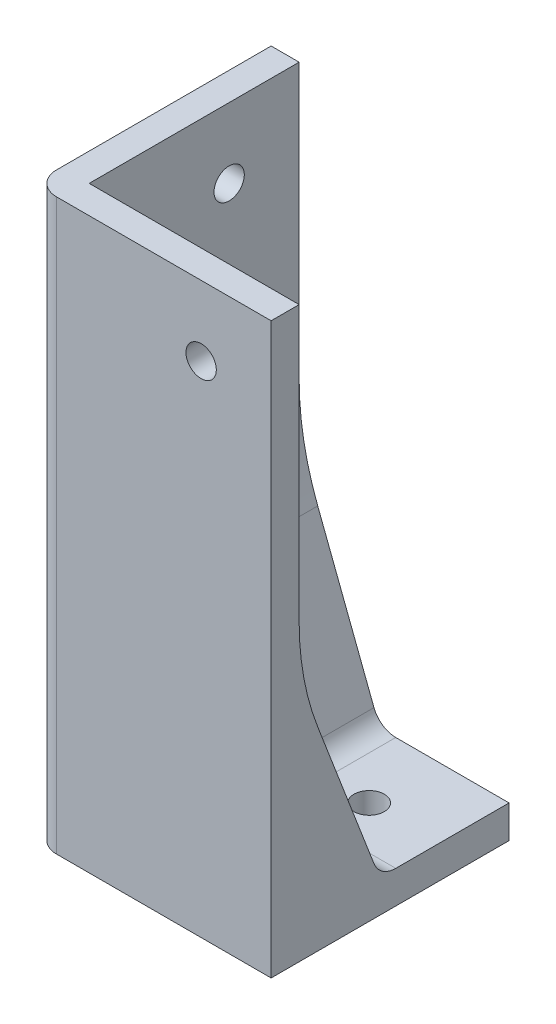
ISO-10303-21;
HEADER;
FILE_DESCRIPTION(('STEP AP214'),'2;1');
FILE_NAME('part.step','',(''),(''),'','','');
FILE_SCHEMA(('AUTOMOTIVE_DESIGN { 1 0 10303 214 1 1 1 1 }'));
ENDSEC;
DATA;
#1=APPLICATION_CONTEXT('core data for automotive mechanical design processes');
#2=APPLICATION_PROTOCOL_DEFINITION('international standard','automotive_design',2000,#1);
#3=PRODUCT_CONTEXT('',#1,'mechanical');
#4=PRODUCT('Part','Part','',(#3));
#5=PRODUCT_RELATED_PRODUCT_CATEGORY('part','',(#4));
#6=PRODUCT_DEFINITION_FORMATION('','',#4);
#7=PRODUCT_DEFINITION_CONTEXT('part definition',#1,'design');
#8=PRODUCT_DEFINITION('design','',#6,#7);
#9=PRODUCT_DEFINITION_SHAPE('','',#8);
#10=(LENGTH_UNIT() NAMED_UNIT(*) SI_UNIT(.MILLI.,.METRE.));
#11=(NAMED_UNIT(*) PLANE_ANGLE_UNIT() SI_UNIT($,.RADIAN.));
#12=(NAMED_UNIT(*) SI_UNIT($,.STERADIAN.) SOLID_ANGLE_UNIT());
#13=UNCERTAINTY_MEASURE_WITH_UNIT(LENGTH_MEASURE(1.E-05),#10,'distance_accuracy_value','');
#14=(GEOMETRIC_REPRESENTATION_CONTEXT(3) GLOBAL_UNCERTAINTY_ASSIGNED_CONTEXT((#13)) GLOBAL_UNIT_ASSIGNED_CONTEXT((#10,
#11,#12)) REPRESENTATION_CONTEXT('',''));
#15=CARTESIAN_POINT('',(0.,0.,0.));
#16=DIRECTION('',(0.,0.,1.));
#17=DIRECTION('',(1.,0.,0.));
#18=AXIS2_PLACEMENT_3D('',#15,#16,#17);
#19=CARTESIAN_POINT('',(0.,7.,0.));
#20=DIRECTION('',(0.,1.,0.));
#21=DIRECTION('',(0.,0.,1.));
#22=AXIS2_PLACEMENT_3D('',#19,#20,#21);
#23=PLANE('',#22);
#24=DIRECTION('',(-1.,0.,0.));
#25=VECTOR('',#24,1.);
#26=CARTESIAN_POINT('',(0.,7.,-51.));
#27=LINE('',#26,#25);
#28=CARTESIAN_POINT('',(51.,7.,-51.));
#29=VERTEX_POINT('',#28);
#30=CARTESIAN_POINT('',(26.7102863696018,7.,-51.));
#31=VERTEX_POINT('',#30);
#32=EDGE_CURVE('E159',#29,#31,#27,.T.);
#33=ORIENTED_EDGE('',*,*,#32,.T.);
#34=DIRECTION('',(0.,0.,1.));
#35=VECTOR('',#34,1.);
#36=CARTESIAN_POINT('',(26.7102863696018,7.,0.));
#37=LINE('',#36,#35);
#38=CARTESIAN_POINT('',(26.7102863696018,7.,-26.7102863696018));
#39=VERTEX_POINT('',#38);
#40=EDGE_CURVE('E310',#31,#39,#37,.T.);
#41=ORIENTED_EDGE('',*,*,#40,.T.);
#42=DIRECTION('',(1.,0.,0.));
#43=VECTOR('',#42,1.);
#44=CARTESIAN_POINT('',(0.,7.,-26.7102863696018));
#45=LINE('',#44,#43);
#46=CARTESIAN_POINT('',(51.,7.,-26.7102863696018));
#47=VERTEX_POINT('',#46);
#48=EDGE_CURVE('E200',#39,#47,#45,.T.);
#49=ORIENTED_EDGE('',*,*,#48,.T.);
#50=DIRECTION('',(0.,0.,-1.));
#51=VECTOR('',#50,1.);
#52=CARTESIAN_POINT('',(51.,7.,0.));
#53=LINE('',#52,#51);
#54=EDGE_CURVE('E202',#47,#29,#53,.T.);
#55=ORIENTED_EDGE('',*,*,#54,.T.);
#56=EDGE_LOOP('',(#33,#41,#49,#55));
#57=FACE_BOUND('',#56,.T.);
#58=CARTESIAN_POINT('',(36.,7.,-36.));
#59=DIRECTION('',(0.,1.,0.));
#60=DIRECTION('',(0.,0.,1.));
#61=AXIS2_PLACEMENT_3D('',#58,#59,#60);
#62=CIRCLE('',#61,3.25);
#63=CARTESIAN_POINT('',(36.,7.,-32.75));
#64=VERTEX_POINT('',#63);
#65=EDGE_CURVE('E153',#64,#64,#62,.T.);
#66=ORIENTED_EDGE('',*,*,#65,.F.);
#67=EDGE_LOOP('',(#66));
#68=FACE_BOUND('',#67,.T.);
#69=ADVANCED_FACE('F32',(#57,#68),#23,.T.);
#70=CARTESIAN_POINT('',(0.,0.,0.));
#71=DIRECTION('',(0.,1.,0.));
#72=DIRECTION('',(0.,0.,1.));
#73=AXIS2_PLACEMENT_3D('',#70,#71,#72);
#74=PLANE('',#73);
#75=DIRECTION('',(1.,0.,0.));
#76=VECTOR('',#75,1.);
#77=CARTESIAN_POINT('',(0.,0.,0.));
#78=LINE('',#77,#76);
#79=CARTESIAN_POINT('',(5.,0.,0.));
#80=VERTEX_POINT('',#79);
#81=CARTESIAN_POINT('',(51.,0.,0.));
#82=VERTEX_POINT('',#81);
#83=EDGE_CURVE('E211',#80,#82,#78,.T.);
#84=ORIENTED_EDGE('',*,*,#83,.F.);
#85=CARTESIAN_POINT('',(5.,0.,-5.));
#86=DIRECTION('',(0.,1.,0.));
#87=DIRECTION('',(0.,0.,1.));
#88=AXIS2_PLACEMENT_3D('',#85,#86,#87);
#89=CIRCLE('',#88,5.);
#90=CARTESIAN_POINT('',(0.,0.,-5.));
#91=VERTEX_POINT('',#90);
#92=EDGE_CURVE('E181',#80,#91,#89,.F.);
#93=ORIENTED_EDGE('',*,*,#92,.T.);
#94=DIRECTION('',(0.,0.,1.));
#95=VECTOR('',#94,1.);
#96=CARTESIAN_POINT('',(0.,0.,0.));
#97=LINE('',#96,#95);
#98=CARTESIAN_POINT('',(0.,0.,-51.));
#99=VERTEX_POINT('',#98);
#100=EDGE_CURVE('E205',#99,#91,#97,.T.);
#101=ORIENTED_EDGE('',*,*,#100,.F.);
#102=DIRECTION('',(-1.,0.,0.));
#103=VECTOR('',#102,1.);
#104=CARTESIAN_POINT('',(0.,0.,-51.));
#105=LINE('',#104,#103);
#106=CARTESIAN_POINT('',(51.,0.,-51.));
#107=VERTEX_POINT('',#106);
#108=EDGE_CURVE('E215',#107,#99,#105,.T.);
#109=ORIENTED_EDGE('',*,*,#108,.F.);
#110=DIRECTION('',(0.,0.,-1.));
#111=VECTOR('',#110,1.);
#112=CARTESIAN_POINT('',(51.,0.,0.));
#113=LINE('',#112,#111);
#114=EDGE_CURVE('E213',#82,#107,#113,.T.);
#115=ORIENTED_EDGE('',*,*,#114,.F.);
#116=EDGE_LOOP('',(#84,#93,#101,#109,#115));
#117=FACE_BOUND('',#116,.T.);
#118=CARTESIAN_POINT('',(36.,0.,-36.));
#119=DIRECTION('',(0.,1.,0.));
#120=DIRECTION('',(0.,0.,1.));
#121=AXIS2_PLACEMENT_3D('',#118,#119,#120);
#122=CIRCLE('',#121,3.25);
#123=CARTESIAN_POINT('',(36.,0.,-32.75));
#124=VERTEX_POINT('',#123);
#125=EDGE_CURVE('E150',#124,#124,#122,.T.);
#126=ORIENTED_EDGE('',*,*,#125,.T.);
#127=EDGE_LOOP('',(#126));
#128=FACE_BOUND('',#127,.T.);
#129=ADVANCED_FACE('F232',(#117,#128),#74,.F.);
#130=CARTESIAN_POINT('',(0.,7.,0.));
#131=DIRECTION('',(0.,0.,-1.));
#132=DIRECTION('',(-1.,0.,0.));
#133=AXIS2_PLACEMENT_3D('',#130,#131,#132);
#134=PLANE('',#133);
#135=CARTESIAN_POINT('',(36.,107.,0.));
#136=DIRECTION('',(0.,0.,1.));
#137=DIRECTION('',(1.,0.,0.));
#138=AXIS2_PLACEMENT_3D('',#135,#136,#137);
#139=CIRCLE('',#138,3.24999999999999);
#140=CARTESIAN_POINT('',(39.25,107.,0.));
#141=VERTEX_POINT('',#140);
#142=EDGE_CURVE('E327',#141,#141,#139,.T.);
#143=ORIENTED_EDGE('',*,*,#142,.F.);
#144=EDGE_LOOP('',(#143));
#145=FACE_BOUND('',#144,.T.);
#146=DIRECTION('',(1.,0.,0.));
#147=VECTOR('',#146,1.);
#148=CARTESIAN_POINT('',(51.,122.,0.));
#149=LINE('',#148,#147);
#150=CARTESIAN_POINT('',(5.,122.,0.));
#151=VERTEX_POINT('',#150);
#152=CARTESIAN_POINT('',(51.,122.,0.));
#153=VERTEX_POINT('',#152);
#154=EDGE_CURVE('E142',#151,#153,#149,.T.);
#155=ORIENTED_EDGE('',*,*,#154,.F.);
#156=DIRECTION('',(0.,-1.,0.));
#157=VECTOR('',#156,1.);
#158=CARTESIAN_POINT('',(5.,7.,0.));
#159=LINE('',#158,#157);
#160=EDGE_CURVE('E174',#151,#80,#159,.T.);
#161=ORIENTED_EDGE('',*,*,#160,.T.);
#162=ORIENTED_EDGE('',*,*,#83,.T.);
#163=DIRECTION('',(0.,-1.,0.));
#164=VECTOR('',#163,1.);
#165=CARTESIAN_POINT('',(51.,7.,0.));
#166=LINE('',#165,#164);
#167=EDGE_CURVE('E171',#153,#82,#166,.T.);
#168=ORIENTED_EDGE('',*,*,#167,.F.);
#169=EDGE_LOOP('',(#155,#161,#162,#168));
#170=FACE_BOUND('',#169,.T.);
#171=ADVANCED_FACE('F227',(#145,#170),#134,.F.);
#172=CARTESIAN_POINT('',(51.,7.,0.));
#173=DIRECTION('',(-1.,0.,0.));
#174=DIRECTION('',(0.,0.,1.));
#175=AXIS2_PLACEMENT_3D('',#172,#173,#174);
#176=PLANE('',#175);
#177=ORIENTED_EDGE('',*,*,#114,.T.);
#178=DIRECTION('',(0.,-1.,0.));
#179=VECTOR('',#178,1.);
#180=CARTESIAN_POINT('',(51.,7.,-51.));
#181=LINE('',#180,#179);
#182=EDGE_CURVE('E222',#29,#107,#181,.T.);
#183=ORIENTED_EDGE('',*,*,#182,.F.);
#184=ORIENTED_EDGE('',*,*,#54,.F.);
#185=CARTESIAN_POINT('',(51.,12.,-26.7102863696018));
#186=DIRECTION('',(-1.,0.,0.));
#187=DIRECTION('',(0.,0.,1.));
#188=AXIS2_PLACEMENT_3D('',#185,#186,#187);
#189=CIRCLE('',#188,5.);
#190=CARTESIAN_POINT('',(51.,10.2081602522735,-22.0423842371158));
#191=VERTEX_POINT('',#190);
#192=EDGE_CURVE('E11',#47,#191,#189,.T.);
#193=ORIENTED_EDGE('',*,*,#192,.T.);
#194=DIRECTION('',(0.,0.9335804264972,0.358367949545304));
#195=VECTOR('',#194,1.);
#196=CARTESIAN_POINT('',(51.,14.7866332458353,-20.2848731195065));
#197=LINE('',#196,#195);
#198=CARTESIAN_POINT('',(51.,41.6182657231735,-9.98517441016799));
#199=VERTEX_POINT('',#198);
#200=EDGE_CURVE('E168',#191,#199,#197,.T.);
#201=ORIENTED_EDGE('',*,*,#200,.T.);
#202=CARTESIAN_POINT('',(51.,63.1203426958918,-66.));
#203=DIRECTION('',(-1.,0.,0.));
#204=DIRECTION('',(0.,0.,1.));
#205=AXIS2_PLACEMENT_3D('',#202,#203,#204);
#206=CIRCLE('',#205,60.);
#207=CARTESIAN_POINT('',(51.,63.1203426958918,-6.00000000000001));
#208=VERTEX_POINT('',#207);
#209=EDGE_CURVE('E149',#199,#208,#206,.T.);
#210=ORIENTED_EDGE('',*,*,#209,.T.);
#211=DIRECTION('',(0.,-1.,0.));
#212=VECTOR('',#211,1.);
#213=CARTESIAN_POINT('',(51.,122.,-6.00000000000001));
#214=LINE('',#213,#212);
#215=CARTESIAN_POINT('',(51.,122.,-6.00000000000001));
#216=VERTEX_POINT('',#215);
#217=EDGE_CURVE('E129',#216,#208,#214,.T.);
#218=ORIENTED_EDGE('',*,*,#217,.F.);
#219=DIRECTION('',(0.,0.,-1.));
#220=VECTOR('',#219,1.);
#221=CARTESIAN_POINT('',(51.,122.,-6.00000000000001));
#222=LINE('',#221,#220);
#223=EDGE_CURVE('E136',#153,#216,#222,.T.);
#224=ORIENTED_EDGE('',*,*,#223,.F.);
#225=ORIENTED_EDGE('',*,*,#167,.T.);
#226=EDGE_LOOP('',(#177,#183,#184,#193,#201,#210,#218,#224,#225));
#227=FACE_BOUND('',#226,.T.);
#228=ADVANCED_FACE('F147',(#227),#176,.F.);
#229=CARTESIAN_POINT('',(0.,7.,-51.));
#230=DIRECTION('',(0.,0.,1.));
#231=DIRECTION('',(1.,0.,0.));
#232=AXIS2_PLACEMENT_3D('',#229,#230,#231);
#233=PLANE('',#232);
#234=ORIENTED_EDGE('',*,*,#108,.T.);
#235=DIRECTION('',(0.,-1.,0.));
#236=VECTOR('',#235,1.);
#237=CARTESIAN_POINT('',(0.,7.,-51.));
#238=LINE('',#237,#236);
#239=CARTESIAN_POINT('',(0.,122.,-51.));
#240=VERTEX_POINT('',#239);
#241=EDGE_CURVE('E219',#240,#99,#238,.T.);
#242=ORIENTED_EDGE('',*,*,#241,.F.);
#243=DIRECTION('',(-1.,0.,0.));
#244=VECTOR('',#243,1.);
#245=CARTESIAN_POINT('',(0.,122.,-51.));
#246=LINE('',#245,#244);
#247=CARTESIAN_POINT('',(6.,122.,-51.));
#248=VERTEX_POINT('',#247);
#249=EDGE_CURVE('E246',#248,#240,#246,.T.);
#250=ORIENTED_EDGE('',*,*,#249,.F.);
#251=DIRECTION('',(0.,-1.,0.));
#252=VECTOR('',#251,1.);
#253=CARTESIAN_POINT('',(6.,122.,-51.));
#254=LINE('',#253,#252);
#255=CARTESIAN_POINT('',(6.,63.1203426958917,-51.));
#256=VERTEX_POINT('',#255);
#257=EDGE_CURVE('E155',#248,#256,#254,.T.);
#258=ORIENTED_EDGE('',*,*,#257,.T.);
#259=CARTESIAN_POINT('',(66.,63.1203426958917,-51.));
#260=DIRECTION('',(0.,0.,1.));
#261=DIRECTION('',(1.,0.,0.));
#262=AXIS2_PLACEMENT_3D('',#259,#260,#261);
#263=CIRCLE('',#262,60.);
#264=CARTESIAN_POINT('',(9.98517441016799,41.6182657231735,-51.));
#265=VERTEX_POINT('',#264);
#266=EDGE_CURVE('E198',#256,#265,#263,.T.);
#267=ORIENTED_EDGE('',*,*,#266,.T.);
#268=DIRECTION('',(0.358367949545304,-0.9335804264972,0.));
#269=VECTOR('',#268,1.);
#270=CARTESIAN_POINT('',(20.2848731195065,14.7866332458353,-51.));
#271=LINE('',#270,#269);
#272=CARTESIAN_POINT('',(22.0423842371158,10.2081602522735,-51.));
#273=VERTEX_POINT('',#272);
#274=EDGE_CURVE('E170',#265,#273,#271,.T.);
#275=ORIENTED_EDGE('',*,*,#274,.T.);
#276=CARTESIAN_POINT('',(26.7102863696018,12.,-51.));
#277=DIRECTION('',(0.,0.,1.));
#278=DIRECTION('',(1.,0.,0.));
#279=AXIS2_PLACEMENT_3D('',#276,#277,#278);
#280=CIRCLE('',#279,5.);
#281=EDGE_CURVE('E41',#273,#31,#280,.T.);
#282=ORIENTED_EDGE('',*,*,#281,.T.);
#283=ORIENTED_EDGE('',*,*,#32,.F.);
#284=ORIENTED_EDGE('',*,*,#182,.T.);
#285=EDGE_LOOP('',(#234,#242,#250,#258,#267,#275,#282,#283,#284));
#286=FACE_BOUND('',#285,.T.);
#287=ADVANCED_FACE('F236',(#286),#233,.F.);
#288=CARTESIAN_POINT('',(0.,7.,0.));
#289=DIRECTION('',(1.,0.,0.));
#290=DIRECTION('',(0.,0.,-1.));
#291=AXIS2_PLACEMENT_3D('',#288,#289,#290);
#292=PLANE('',#291);
#293=CARTESIAN_POINT('',(0.,107.,-36.));
#294=DIRECTION('',(-1.,0.,0.));
#295=DIRECTION('',(0.,0.,1.));
#296=AXIS2_PLACEMENT_3D('',#293,#294,#295);
#297=CIRCLE('',#296,3.24999999999999);
#298=CARTESIAN_POINT('',(0.,107.,-32.75));
#299=VERTEX_POINT('',#298);
#300=EDGE_CURVE('E177',#299,#299,#297,.T.);
#301=ORIENTED_EDGE('',*,*,#300,.F.);
#302=EDGE_LOOP('',(#301));
#303=FACE_BOUND('',#302,.T.);
#304=ORIENTED_EDGE('',*,*,#100,.T.);
#305=DIRECTION('',(0.,-1.,0.));
#306=VECTOR('',#305,1.);
#307=CARTESIAN_POINT('',(0.,7.,-5.));
#308=LINE('',#307,#306);
#309=CARTESIAN_POINT('',(0.,122.,-5.));
#310=VERTEX_POINT('',#309);
#311=EDGE_CURVE('E183',#91,#310,#308,.F.);
#312=ORIENTED_EDGE('',*,*,#311,.T.);
#313=DIRECTION('',(0.,0.,1.));
#314=VECTOR('',#313,1.);
#315=CARTESIAN_POINT('',(0.,122.,0.));
#316=LINE('',#315,#314);
#317=EDGE_CURVE('E244',#240,#310,#316,.T.);
#318=ORIENTED_EDGE('',*,*,#317,.F.);
#319=ORIENTED_EDGE('',*,*,#241,.T.);
#320=EDGE_LOOP('',(#304,#312,#318,#319));
#321=FACE_BOUND('',#320,.T.);
#322=ADVANCED_FACE('F242',(#303,#321),#292,.F.);
#323=CARTESIAN_POINT('',(36.,7.,-36.));
#324=DIRECTION('',(0.,-1.,0.));
#325=DIRECTION('',(0.,0.,-1.));
#326=AXIS2_PLACEMENT_3D('',#323,#324,#325);
#327=CYLINDRICAL_SURFACE('',#326,3.25);
#328=ORIENTED_EDGE('',*,*,#65,.T.);
#329=EDGE_LOOP('',(#328));
#330=FACE_BOUND('',#329,.T.);
#331=ORIENTED_EDGE('',*,*,#125,.F.);
#332=EDGE_LOOP('',(#331));
#333=FACE_BOUND('',#332,.T.);
#334=ADVANCED_FACE('F254',(#330,#333),#327,.F.);
#335=CARTESIAN_POINT('',(6.00000000000001,122.,-6.00000000000001));
#336=DIRECTION('',(0.,0.,1.));
#337=DIRECTION('',(1.,0.,0.));
#338=AXIS2_PLACEMENT_3D('',#335,#336,#337);
#339=PLANE('',#338);
#340=CARTESIAN_POINT('',(36.,107.,-6.00000000000001));
#341=DIRECTION('',(0.,0.,1.));
#342=DIRECTION('',(1.,0.,0.));
#343=AXIS2_PLACEMENT_3D('',#340,#341,#342);
#344=CIRCLE('',#343,3.24999999999999);
#345=CARTESIAN_POINT('',(39.25,107.,-6.00000000000001));
#346=VERTEX_POINT('',#345);
#347=EDGE_CURVE('E145',#346,#346,#344,.T.);
#348=ORIENTED_EDGE('',*,*,#347,.T.);
#349=EDGE_LOOP('',(#348));
#350=FACE_BOUND('',#349,.T.);
#351=ORIENTED_EDGE('',*,*,#217,.T.);
#352=DIRECTION('',(-1.,0.,0.));
#353=VECTOR('',#352,1.);
#354=CARTESIAN_POINT('',(6.00000000000001,63.1203426958918,-6.00000000000001));
#355=LINE('',#354,#353);
#356=CARTESIAN_POINT('',(6.00000000000001,63.1203426958917,-6.00000000000001));
#357=VERTEX_POINT('',#356);
#358=EDGE_CURVE('E187',#208,#357,#355,.T.);
#359=ORIENTED_EDGE('',*,*,#358,.T.);
#360=DIRECTION('',(0.,-1.,0.));
#361=VECTOR('',#360,1.);
#362=CARTESIAN_POINT('',(6.00000000000001,122.,-6.00000000000001));
#363=LINE('',#362,#361);
#364=CARTESIAN_POINT('',(6.00000000000001,122.,-6.00000000000001));
#365=VERTEX_POINT('',#364);
#366=EDGE_CURVE('E132',#365,#357,#363,.T.);
#367=ORIENTED_EDGE('',*,*,#366,.F.);
#368=DIRECTION('',(-1.,0.,0.));
#369=VECTOR('',#368,1.);
#370=CARTESIAN_POINT('',(6.00000000000001,122.,-6.00000000000001));
#371=LINE('',#370,#369);
#372=EDGE_CURVE('E124',#216,#365,#371,.T.);
#373=ORIENTED_EDGE('',*,*,#372,.F.);
#374=EDGE_LOOP('',(#351,#359,#367,#373));
#375=FACE_BOUND('',#374,.T.);
#376=ADVANCED_FACE('F126',(#350,#375),#339,.F.);
#377=CARTESIAN_POINT('',(6.,122.,-51.));
#378=DIRECTION('',(-1.,0.,0.));
#379=DIRECTION('',(0.,0.,1.));
#380=AXIS2_PLACEMENT_3D('',#377,#378,#379);
#381=PLANE('',#380);
#382=CARTESIAN_POINT('',(6.00000000000001,107.,-36.));
#383=DIRECTION('',(-1.,0.,0.));
#384=DIRECTION('',(0.,0.,1.));
#385=AXIS2_PLACEMENT_3D('',#382,#383,#384);
#386=CIRCLE('',#385,3.24999999999999);
#387=CARTESIAN_POINT('',(6.00000000000001,107.,-32.75));
#388=VERTEX_POINT('',#387);
#389=EDGE_CURVE('E330',#388,#388,#386,.T.);
#390=ORIENTED_EDGE('',*,*,#389,.T.);
#391=EDGE_LOOP('',(#390));
#392=FACE_BOUND('',#391,.T.);
#393=ORIENTED_EDGE('',*,*,#366,.T.);
#394=DIRECTION('',(0.,0.,-1.));
#395=VECTOR('',#394,1.);
#396=CARTESIAN_POINT('',(6.,63.1203426958917,-51.));
#397=LINE('',#396,#395);
#398=EDGE_CURVE('E192',#357,#256,#397,.T.);
#399=ORIENTED_EDGE('',*,*,#398,.T.);
#400=ORIENTED_EDGE('',*,*,#257,.F.);
#401=DIRECTION('',(0.,0.,-1.));
#402=VECTOR('',#401,1.);
#403=CARTESIAN_POINT('',(6.,122.,-51.));
#404=LINE('',#403,#402);
#405=EDGE_CURVE('E135',#365,#248,#404,.T.);
#406=ORIENTED_EDGE('',*,*,#405,.F.);
#407=EDGE_LOOP('',(#393,#399,#400,#406));
#408=FACE_BOUND('',#407,.T.);
#409=ADVANCED_FACE('F323',(#392,#408),#381,.F.);
#410=CARTESIAN_POINT('',(0.,122.,0.));
#411=DIRECTION('',(0.,-1.,0.));
#412=DIRECTION('',(0.,0.,-1.));
#413=AXIS2_PLACEMENT_3D('',#410,#411,#412);
#414=PLANE('',#413);
#415=ORIENTED_EDGE('',*,*,#317,.T.);
#416=CARTESIAN_POINT('',(5.,122.,-5.));
#417=DIRECTION('',(0.,-1.,0.));
#418=DIRECTION('',(0.,0.,-1.));
#419=AXIS2_PLACEMENT_3D('',#416,#417,#418);
#420=CIRCLE('',#419,5.);
#421=EDGE_CURVE('E185',#310,#151,#420,.F.);
#422=ORIENTED_EDGE('',*,*,#421,.T.);
#423=ORIENTED_EDGE('',*,*,#154,.T.);
#424=ORIENTED_EDGE('',*,*,#223,.T.);
#425=ORIENTED_EDGE('',*,*,#372,.T.);
#426=ORIENTED_EDGE('',*,*,#405,.T.);
#427=ORIENTED_EDGE('',*,*,#249,.T.);
#428=EDGE_LOOP('',(#415,#422,#423,#424,#425,#426,#427));
#429=FACE_BOUND('',#428,.T.);
#430=ADVANCED_FACE('F140',(#429),#414,.F.);
#431=CARTESIAN_POINT('',(36.,107.,0.));
#432=DIRECTION('',(0.,0.,1.));
#433=DIRECTION('',(1.,0.,0.));
#434=AXIS2_PLACEMENT_3D('',#431,#432,#433);
#435=CYLINDRICAL_SURFACE('',#434,3.24999999999999);
#436=ORIENTED_EDGE('',*,*,#347,.F.);
#437=EDGE_LOOP('',(#436));
#438=FACE_BOUND('',#437,.T.);
#439=ORIENTED_EDGE('',*,*,#142,.T.);
#440=EDGE_LOOP('',(#439));
#441=FACE_BOUND('',#440,.T.);
#442=ADVANCED_FACE('F337',(#438,#441),#435,.F.);
#443=CARTESIAN_POINT('',(0.,107.,-36.));
#444=DIRECTION('',(-1.,0.,0.));
#445=DIRECTION('',(0.,0.,1.));
#446=AXIS2_PLACEMENT_3D('',#443,#444,#445);
#447=CYLINDRICAL_SURFACE('',#446,3.24999999999999);
#448=ORIENTED_EDGE('',*,*,#389,.F.);
#449=EDGE_LOOP('',(#448));
#450=FACE_BOUND('',#449,.T.);
#451=ORIENTED_EDGE('',*,*,#300,.T.);
#452=EDGE_LOOP('',(#451));
#453=FACE_BOUND('',#452,.T.);
#454=ADVANCED_FACE('F285',(#450,#453),#447,.F.);
#455=CARTESIAN_POINT('',(6.,51.9999999999996,-51.));
#456=DIRECTION('',(-0.9335804264972,-0.358367949545304,0.));
#457=DIRECTION('',(0.,0.,-1.));
#458=AXIS2_PLACEMENT_3D('',#455,#456,#457);
#459=PLANE('',#458);
#460=DIRECTION('',(0.337359010587713,-0.87885026935796,-0.337359010587713));
#461=VECTOR('',#460,1.);
#462=CARTESIAN_POINT('',(6.00000000000001,51.9999999999996,-6.00000000000001));
#463=LINE('',#462,#461);
#464=CARTESIAN_POINT('',(22.0423842371158,10.2081602522735,-22.0423842371158));
#465=VERTEX_POINT('',#464);
#466=CARTESIAN_POINT('',(9.98517441016799,41.6182657231735,-9.98517441016799));
#467=VERTEX_POINT('',#466);
#468=EDGE_CURVE('E175',#465,#467,#463,.F.);
#469=ORIENTED_EDGE('',*,*,#468,.F.);
#470=DIRECTION('',(0.,0.,1.));
#471=VECTOR('',#470,1.);
#472=CARTESIAN_POINT('',(22.0423842371158,10.2081602522735,-51.));
#473=LINE('',#472,#471);
#474=EDGE_CURVE('E307',#465,#273,#473,.F.);
#475=ORIENTED_EDGE('',*,*,#474,.T.);
#476=ORIENTED_EDGE('',*,*,#274,.F.);
#477=DIRECTION('',(0.,0.,-1.));
#478=VECTOR('',#477,1.);
#479=CARTESIAN_POINT('',(9.985174410168,41.6182657231735,-6.));
#480=LINE('',#479,#478);
#481=EDGE_CURVE('E194',#265,#467,#480,.F.);
#482=ORIENTED_EDGE('',*,*,#481,.T.);
#483=EDGE_LOOP('',(#469,#475,#476,#482));
#484=FACE_BOUND('',#483,.T.);
#485=ADVANCED_FACE('F282',(#484),#459,.F.);
#486=CARTESIAN_POINT('',(6.00000000000001,51.9999999999996,-6.00000000000001));
#487=DIRECTION('',(0.,-0.358367949545304,0.9335804264972));
#488=DIRECTION('',(-1.,0.,0.));
#489=AXIS2_PLACEMENT_3D('',#486,#487,#488);
#490=PLANE('',#489);
#491=ORIENTED_EDGE('',*,*,#200,.F.);
#492=DIRECTION('',(1.,0.,0.));
#493=VECTOR('',#492,1.);
#494=CARTESIAN_POINT('',(6.00000000000001,10.2081602522735,-22.0423842371158));
#495=LINE('',#494,#493);
#496=EDGE_CURVE('E53',#191,#465,#495,.F.);
#497=ORIENTED_EDGE('',*,*,#496,.T.);
#498=ORIENTED_EDGE('',*,*,#468,.T.);
#499=DIRECTION('',(-1.,0.,0.));
#500=VECTOR('',#499,1.);
#501=CARTESIAN_POINT('',(51.,41.6182657231735,-9.98517441016799));
#502=LINE('',#501,#500);
#503=EDGE_CURVE('E189',#467,#199,#502,.F.);
#504=ORIENTED_EDGE('',*,*,#503,.T.);
#505=EDGE_LOOP('',(#491,#497,#498,#504));
#506=FACE_BOUND('',#505,.T.);
#507=ADVANCED_FACE('F278',(#506),#490,.F.);
#508=CARTESIAN_POINT('',(5.,7.,-5.));
#509=DIRECTION('',(0.,-1.,0.));
#510=DIRECTION('',(0.,0.,-1.));
#511=AXIS2_PLACEMENT_3D('',#508,#509,#510);
#512=CYLINDRICAL_SURFACE('',#511,5.);
#513=ORIENTED_EDGE('',*,*,#421,.F.);
#514=ORIENTED_EDGE('',*,*,#311,.F.);
#515=ORIENTED_EDGE('',*,*,#92,.F.);
#516=ORIENTED_EDGE('',*,*,#160,.F.);
#517=EDGE_LOOP('',(#513,#514,#515,#516));
#518=FACE_BOUND('',#517,.T.);
#519=ADVANCED_FACE('F281',(#518),#512,.T.);
#520=CARTESIAN_POINT('',(66.,63.1203426958917,-51.));
#521=DIRECTION('',(0.,0.,1.));
#522=DIRECTION('',(1.,0.,0.));
#523=AXIS2_PLACEMENT_3D('',#520,#521,#522);
#524=CYLINDRICAL_SURFACE('',#523,60.);
#525=ORIENTED_EDGE('',*,*,#266,.F.);
#526=ORIENTED_EDGE('',*,*,#398,.F.);
#527=CARTESIAN_POINT('',(66.,63.1203426958917,-66.));
#528=DIRECTION('',(0.707106781186548,0.,0.707106781186547));
#529=DIRECTION('',(0.707106781186547,0.,-0.707106781186548));
#530=AXIS2_PLACEMENT_3D('',#527,#528,#529);
#531=ELLIPSE('',#530,84.8528137423857,60.);
#532=EDGE_CURVE('E178',#467,#357,#531,.F.);
#533=ORIENTED_EDGE('',*,*,#532,.F.);
#534=ORIENTED_EDGE('',*,*,#481,.F.);
#535=EDGE_LOOP('',(#525,#526,#533,#534));
#536=FACE_BOUND('',#535,.T.);
#537=ADVANCED_FACE('F289',(#536),#524,.F.);
#538=CARTESIAN_POINT('',(6.,63.1203426958918,-66.));
#539=DIRECTION('',(1.,0.,0.));
#540=DIRECTION('',(0.,0.,-1.));
#541=AXIS2_PLACEMENT_3D('',#538,#539,#540);
#542=CYLINDRICAL_SURFACE('',#541,60.);
#543=ORIENTED_EDGE('',*,*,#209,.F.);
#544=ORIENTED_EDGE('',*,*,#503,.F.);
#545=ORIENTED_EDGE('',*,*,#532,.T.);
#546=ORIENTED_EDGE('',*,*,#358,.F.);
#547=EDGE_LOOP('',(#543,#544,#545,#546));
#548=FACE_BOUND('',#547,.T.);
#549=ADVANCED_FACE('F291',(#548),#542,.F.);
#550=CARTESIAN_POINT('',(0.,12.,-26.7102863696018));
#551=DIRECTION('',(1.,0.,0.));
#552=DIRECTION('',(0.,0.,-1.));
#553=AXIS2_PLACEMENT_3D('',#550,#551,#552);
#554=CYLINDRICAL_SURFACE('',#553,5.);
#555=ORIENTED_EDGE('',*,*,#192,.F.);
#556=ORIENTED_EDGE('',*,*,#48,.F.);
#557=CARTESIAN_POINT('',(26.7102863696018,12.,-26.7102863696018));
#558=DIRECTION('',(0.707106781186548,0.,0.707106781186547));
#559=DIRECTION('',(-0.707106781186547,0.,0.707106781186548));
#560=AXIS2_PLACEMENT_3D('',#557,#558,#559);
#561=ELLIPSE('',#560,7.07106781186547,5.);
#562=EDGE_CURVE('E36',#465,#39,#561,.T.);
#563=ORIENTED_EDGE('',*,*,#562,.F.);
#564=ORIENTED_EDGE('',*,*,#496,.F.);
#565=EDGE_LOOP('',(#555,#556,#563,#564));
#566=FACE_BOUND('',#565,.T.);
#567=ADVANCED_FACE('F34',(#566),#554,.F.);
#568=CARTESIAN_POINT('',(26.7102863696018,12.,0.));
#569=DIRECTION('',(0.,0.,1.));
#570=DIRECTION('',(1.,0.,0.));
#571=AXIS2_PLACEMENT_3D('',#568,#569,#570);
#572=CYLINDRICAL_SURFACE('',#571,5.);
#573=ORIENTED_EDGE('',*,*,#281,.F.);
#574=ORIENTED_EDGE('',*,*,#474,.F.);
#575=ORIENTED_EDGE('',*,*,#562,.T.);
#576=ORIENTED_EDGE('',*,*,#40,.F.);
#577=EDGE_LOOP('',(#573,#574,#575,#576));
#578=FACE_BOUND('',#577,.T.);
#579=ADVANCED_FACE('F297',(#578),#572,.F.);
#580=CLOSED_SHELL('',(#69,#129,#171,#228,#287,#322,#334,#376,#409,#430,#442,#454,#485,#507,#519,
#537,#549,#567,#579));
#581=MANIFOLD_SOLID_BREP('B2',#580);
#582=ADVANCED_BREP_SHAPE_REPRESENTATION('',(#18,#581),#14);
#583=SHAPE_DEFINITION_REPRESENTATION(#9,#582);
ENDSEC;
END-ISO-10303-21;
